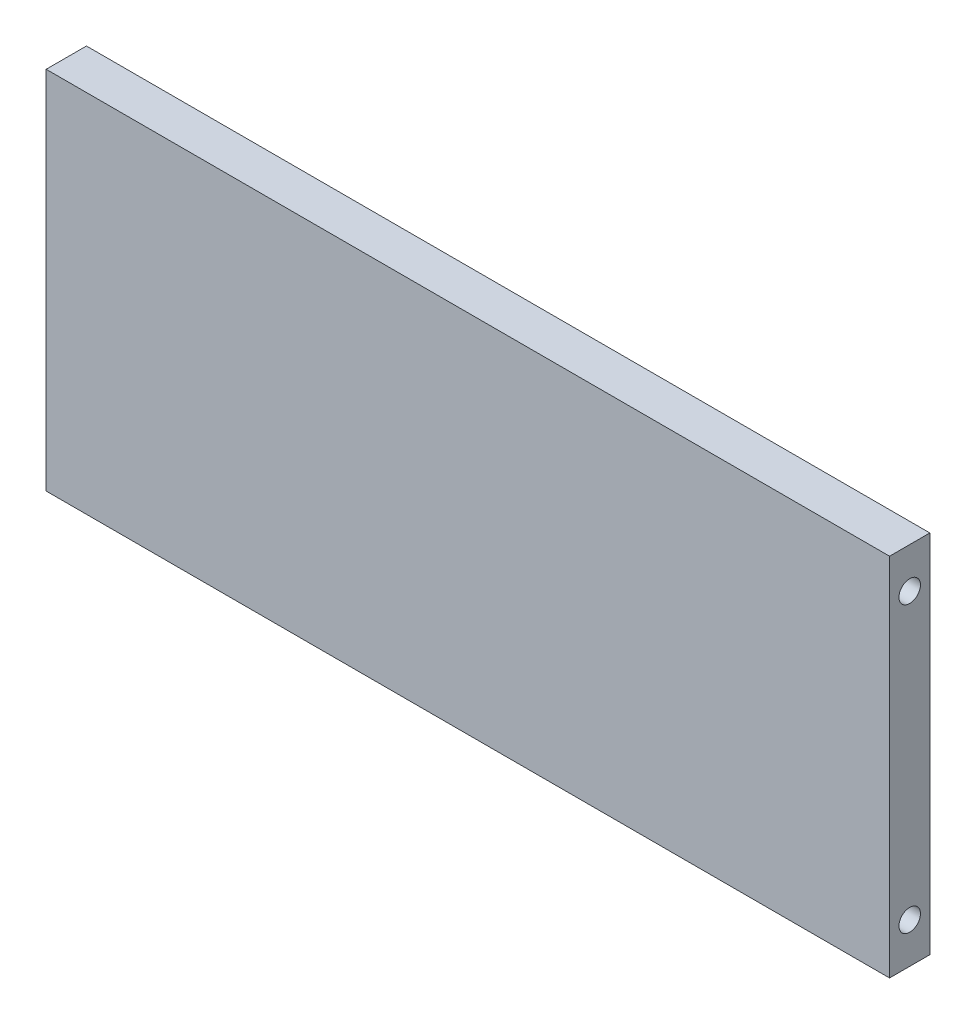
ISO-10303-21;
HEADER;
FILE_DESCRIPTION(('STEP AP214'),'2;1');
FILE_NAME('part.step','',(''),(''),'','','');
FILE_SCHEMA(('AUTOMOTIVE_DESIGN { 1 0 10303 214 1 1 1 1 }'));
ENDSEC;
DATA;
#1=APPLICATION_CONTEXT('core data for automotive mechanical design processes');
#2=APPLICATION_PROTOCOL_DEFINITION('international standard','automotive_design',2000,#1);
#3=PRODUCT_CONTEXT('',#1,'mechanical');
#4=PRODUCT('Part','Part','',(#3));
#5=PRODUCT_RELATED_PRODUCT_CATEGORY('part','',(#4));
#6=PRODUCT_DEFINITION_FORMATION('','',#4);
#7=PRODUCT_DEFINITION_CONTEXT('part definition',#1,'design');
#8=PRODUCT_DEFINITION('design','',#6,#7);
#9=PRODUCT_DEFINITION_SHAPE('','',#8);
#10=(LENGTH_UNIT() NAMED_UNIT(*) SI_UNIT(.MILLI.,.METRE.));
#11=(NAMED_UNIT(*) PLANE_ANGLE_UNIT() SI_UNIT($,.RADIAN.));
#12=(NAMED_UNIT(*) SI_UNIT($,.STERADIAN.) SOLID_ANGLE_UNIT());
#13=UNCERTAINTY_MEASURE_WITH_UNIT(LENGTH_MEASURE(1.E-05),#10,'distance_accuracy_value','');
#14=(GEOMETRIC_REPRESENTATION_CONTEXT(3) GLOBAL_UNCERTAINTY_ASSIGNED_CONTEXT((#13)) GLOBAL_UNIT_ASSIGNED_CONTEXT((#10,
#11,#12)) REPRESENTATION_CONTEXT('',''));
#15=CARTESIAN_POINT('',(0.,0.,0.));
#16=DIRECTION('',(0.,0.,1.));
#17=DIRECTION('',(1.,0.,0.));
#18=AXIS2_PLACEMENT_3D('',#15,#16,#17);
#19=CARTESIAN_POINT('',(157.,-68.,15.));
#20=DIRECTION('',(-1.,0.,0.));
#21=DIRECTION('',(0.,0.,1.));
#22=AXIS2_PLACEMENT_3D('',#19,#20,#21);
#23=PLANE('',#22);
#24=CARTESIAN_POINT('',(157.,-53.,7.50000000000001));
#25=DIRECTION('',(-1.,0.,0.));
#26=DIRECTION('',(0.,0.,1.));
#27=AXIS2_PLACEMENT_3D('',#24,#25,#26);
#28=CIRCLE('',#27,4.);
#29=CARTESIAN_POINT('',(157.,-53.,11.5));
#30=VERTEX_POINT('',#29);
#31=EDGE_CURVE('E158',#30,#30,#28,.T.);
#32=ORIENTED_EDGE('',*,*,#31,.T.);
#33=EDGE_LOOP('',(#32));
#34=FACE_BOUND('',#33,.T.);
#35=CARTESIAN_POINT('',(157.,53.,7.50000000000001));
#36=DIRECTION('',(-1.,0.,0.));
#37=DIRECTION('',(0.,0.,1.));
#38=AXIS2_PLACEMENT_3D('',#35,#36,#37);
#39=CIRCLE('',#38,4.);
#40=CARTESIAN_POINT('',(157.,53.,11.5));
#41=VERTEX_POINT('',#40);
#42=EDGE_CURVE('E150',#41,#41,#39,.T.);
#43=ORIENTED_EDGE('',*,*,#42,.T.);
#44=EDGE_LOOP('',(#43));
#45=FACE_BOUND('',#44,.T.);
#46=DIRECTION('',(0.,1.,0.));
#47=VECTOR('',#46,1.);
#48=CARTESIAN_POINT('',(157.,-68.,0.));
#49=LINE('',#48,#47);
#50=CARTESIAN_POINT('',(157.,-68.,0.));
#51=VERTEX_POINT('',#50);
#52=CARTESIAN_POINT('',(157.,68.,0.));
#53=VERTEX_POINT('',#52);
#54=EDGE_CURVE('E111',#51,#53,#49,.T.);
#55=ORIENTED_EDGE('',*,*,#54,.T.);
#56=DIRECTION('',(0.,0.,-1.));
#57=VECTOR('',#56,1.);
#58=CARTESIAN_POINT('',(157.,68.,15.));
#59=LINE('',#58,#57);
#60=CARTESIAN_POINT('',(157.,68.,15.));
#61=VERTEX_POINT('',#60);
#62=EDGE_CURVE('E11',#61,#53,#59,.T.);
#63=ORIENTED_EDGE('',*,*,#62,.F.);
#64=DIRECTION('',(0.,1.,0.));
#65=VECTOR('',#64,1.);
#66=CARTESIAN_POINT('',(157.,-68.,15.));
#67=LINE('',#66,#65);
#68=CARTESIAN_POINT('',(157.,-68.,15.));
#69=VERTEX_POINT('',#68);
#70=EDGE_CURVE('E94',#69,#61,#67,.T.);
#71=ORIENTED_EDGE('',*,*,#70,.F.);
#72=DIRECTION('',(0.,0.,-1.));
#73=VECTOR('',#72,1.);
#74=CARTESIAN_POINT('',(157.,-68.,15.));
#75=LINE('',#74,#73);
#76=EDGE_CURVE('E107',#69,#51,#75,.T.);
#77=ORIENTED_EDGE('',*,*,#76,.T.);
#78=EDGE_LOOP('',(#55,#63,#71,#77));
#79=FACE_BOUND('',#78,.T.);
#80=ADVANCED_FACE('F42',(#34,#45,#79),#23,.F.);
#81=CARTESIAN_POINT('',(-157.,68.,15.));
#82=DIRECTION('',(0.,-1.,0.));
#83=DIRECTION('',(0.,0.,-1.));
#84=AXIS2_PLACEMENT_3D('',#81,#82,#83);
#85=PLANE('',#84);
#86=DIRECTION('',(-1.,0.,0.));
#87=VECTOR('',#86,1.);
#88=CARTESIAN_POINT('',(-157.,68.,0.));
#89=LINE('',#88,#87);
#90=CARTESIAN_POINT('',(-157.,68.,0.));
#91=VERTEX_POINT('',#90);
#92=EDGE_CURVE('E99',#53,#91,#89,.T.);
#93=ORIENTED_EDGE('',*,*,#92,.T.);
#94=DIRECTION('',(0.,0.,-1.));
#95=VECTOR('',#94,1.);
#96=CARTESIAN_POINT('',(-157.,68.,15.));
#97=LINE('',#96,#95);
#98=CARTESIAN_POINT('',(-157.,68.,15.));
#99=VERTEX_POINT('',#98);
#100=EDGE_CURVE('E51',#99,#91,#97,.T.);
#101=ORIENTED_EDGE('',*,*,#100,.F.);
#102=DIRECTION('',(-1.,0.,0.));
#103=VECTOR('',#102,1.);
#104=CARTESIAN_POINT('',(-157.,68.,15.));
#105=LINE('',#104,#103);
#106=EDGE_CURVE('E89',#61,#99,#105,.T.);
#107=ORIENTED_EDGE('',*,*,#106,.F.);
#108=ORIENTED_EDGE('',*,*,#62,.T.);
#109=EDGE_LOOP('',(#93,#101,#107,#108));
#110=FACE_BOUND('',#109,.T.);
#111=ADVANCED_FACE('F98',(#110),#85,.F.);
#112=CARTESIAN_POINT('',(-157.,-68.,15.));
#113=DIRECTION('',(1.,0.,0.));
#114=DIRECTION('',(0.,0.,-1.));
#115=AXIS2_PLACEMENT_3D('',#112,#113,#114);
#116=PLANE('',#115);
#117=CARTESIAN_POINT('',(-157.,-53.,7.50000000000001));
#118=DIRECTION('',(-1.,0.,0.));
#119=DIRECTION('',(0.,0.,1.));
#120=AXIS2_PLACEMENT_3D('',#117,#118,#119);
#121=CIRCLE('',#120,4.);
#122=CARTESIAN_POINT('',(-157.,-53.,11.5));
#123=VERTEX_POINT('',#122);
#124=EDGE_CURVE('E142',#123,#123,#121,.T.);
#125=ORIENTED_EDGE('',*,*,#124,.F.);
#126=EDGE_LOOP('',(#125));
#127=FACE_BOUND('',#126,.T.);
#128=CARTESIAN_POINT('',(-157.,53.,7.50000000000001));
#129=DIRECTION('',(-1.,0.,0.));
#130=DIRECTION('',(0.,0.,1.));
#131=AXIS2_PLACEMENT_3D('',#128,#129,#130);
#132=CIRCLE('',#131,4.);
#133=CARTESIAN_POINT('',(-157.,53.,11.5));
#134=VERTEX_POINT('',#133);
#135=EDGE_CURVE('E134',#134,#134,#132,.T.);
#136=ORIENTED_EDGE('',*,*,#135,.F.);
#137=EDGE_LOOP('',(#136));
#138=FACE_BOUND('',#137,.T.);
#139=DIRECTION('',(0.,-1.,0.));
#140=VECTOR('',#139,1.);
#141=CARTESIAN_POINT('',(-157.,-68.,0.));
#142=LINE('',#141,#140);
#143=CARTESIAN_POINT('',(-157.,-68.,0.));
#144=VERTEX_POINT('',#143);
#145=EDGE_CURVE('E76',#91,#144,#142,.T.);
#146=ORIENTED_EDGE('',*,*,#145,.T.);
#147=DIRECTION('',(0.,0.,-1.));
#148=VECTOR('',#147,1.);
#149=CARTESIAN_POINT('',(-157.,-68.,15.));
#150=LINE('',#149,#148);
#151=CARTESIAN_POINT('',(-157.,-68.,15.));
#152=VERTEX_POINT('',#151);
#153=EDGE_CURVE('E101',#152,#144,#150,.T.);
#154=ORIENTED_EDGE('',*,*,#153,.F.);
#155=DIRECTION('',(0.,-1.,0.));
#156=VECTOR('',#155,1.);
#157=CARTESIAN_POINT('',(-157.,-68.,15.));
#158=LINE('',#157,#156);
#159=EDGE_CURVE('E92',#99,#152,#158,.T.);
#160=ORIENTED_EDGE('',*,*,#159,.F.);
#161=ORIENTED_EDGE('',*,*,#100,.T.);
#162=EDGE_LOOP('',(#146,#154,#160,#161));
#163=FACE_BOUND('',#162,.T.);
#164=ADVANCED_FACE('F102',(#127,#138,#163),#116,.F.);
#165=CARTESIAN_POINT('',(-157.,-68.,15.));
#166=DIRECTION('',(0.,1.,0.));
#167=DIRECTION('',(0.,0.,1.));
#168=AXIS2_PLACEMENT_3D('',#165,#166,#167);
#169=PLANE('',#168);
#170=CARTESIAN_POINT('',(142.,-68.,7.50000000000001));
#171=DIRECTION('',(0.,-1.,0.));
#172=DIRECTION('',(0.,0.,-1.));
#173=AXIS2_PLACEMENT_3D('',#170,#171,#172);
#174=CIRCLE('',#173,3.99999999999999);
#175=CARTESIAN_POINT('',(142.,-68.,3.50000000000001));
#176=VERTEX_POINT('',#175);
#177=EDGE_CURVE('E185',#176,#176,#174,.T.);
#178=ORIENTED_EDGE('',*,*,#177,.F.);
#179=EDGE_LOOP('',(#178));
#180=FACE_BOUND('',#179,.T.);
#181=CARTESIAN_POINT('',(0.,-68.,7.50000000000001));
#182=DIRECTION('',(0.,-1.,0.));
#183=DIRECTION('',(0.,0.,-1.));
#184=AXIS2_PLACEMENT_3D('',#181,#182,#183);
#185=CIRCLE('',#184,3.99999999999999);
#186=CARTESIAN_POINT('',(0.,-68.,3.50000000000001));
#187=VERTEX_POINT('',#186);
#188=EDGE_CURVE('E177',#187,#187,#185,.T.);
#189=ORIENTED_EDGE('',*,*,#188,.F.);
#190=EDGE_LOOP('',(#189));
#191=FACE_BOUND('',#190,.T.);
#192=CARTESIAN_POINT('',(-142.,-68.,7.50000000000001));
#193=DIRECTION('',(0.,-1.,0.));
#194=DIRECTION('',(0.,0.,-1.));
#195=AXIS2_PLACEMENT_3D('',#192,#193,#194);
#196=CIRCLE('',#195,3.99999999999999);
#197=CARTESIAN_POINT('',(-142.,-68.,3.50000000000001));
#198=VERTEX_POINT('',#197);
#199=EDGE_CURVE('E166',#198,#198,#196,.T.);
#200=ORIENTED_EDGE('',*,*,#199,.F.);
#201=EDGE_LOOP('',(#200));
#202=FACE_BOUND('',#201,.T.);
#203=DIRECTION('',(1.,0.,0.));
#204=VECTOR('',#203,1.);
#205=CARTESIAN_POINT('',(-157.,-68.,0.));
#206=LINE('',#205,#204);
#207=EDGE_CURVE('E82',#144,#51,#206,.T.);
#208=ORIENTED_EDGE('',*,*,#207,.T.);
#209=ORIENTED_EDGE('',*,*,#76,.F.);
#210=DIRECTION('',(1.,0.,0.));
#211=VECTOR('',#210,1.);
#212=CARTESIAN_POINT('',(-157.,-68.,15.));
#213=LINE('',#212,#211);
#214=EDGE_CURVE('E59',#152,#69,#213,.T.);
#215=ORIENTED_EDGE('',*,*,#214,.F.);
#216=ORIENTED_EDGE('',*,*,#153,.T.);
#217=EDGE_LOOP('',(#208,#209,#215,#216));
#218=FACE_BOUND('',#217,.T.);
#219=ADVANCED_FACE('F126',(#180,#191,#202,#218),#169,.F.);
#220=CARTESIAN_POINT('',(0.,0.,15.));
#221=DIRECTION('',(0.,0.,-1.));
#222=DIRECTION('',(-1.,0.,0.));
#223=AXIS2_PLACEMENT_3D('',#220,#221,#222);
#224=PLANE('',#223);
#225=ORIENTED_EDGE('',*,*,#70,.T.);
#226=ORIENTED_EDGE('',*,*,#106,.T.);
#227=ORIENTED_EDGE('',*,*,#159,.T.);
#228=ORIENTED_EDGE('',*,*,#214,.T.);
#229=EDGE_LOOP('',(#225,#226,#227,#228));
#230=FACE_BOUND('',#229,.T.);
#231=ADVANCED_FACE('F90',(#230),#224,.F.);
#232=CARTESIAN_POINT('',(0.,0.,0.));
#233=DIRECTION('',(0.,0.,-1.));
#234=DIRECTION('',(-1.,0.,0.));
#235=AXIS2_PLACEMENT_3D('',#232,#233,#234);
#236=PLANE('',#235);
#237=ORIENTED_EDGE('',*,*,#54,.F.);
#238=ORIENTED_EDGE('',*,*,#207,.F.);
#239=ORIENTED_EDGE('',*,*,#145,.F.);
#240=ORIENTED_EDGE('',*,*,#92,.F.);
#241=EDGE_LOOP('',(#237,#238,#239,#240));
#242=FACE_BOUND('',#241,.T.);
#243=ADVANCED_FACE('F129',(#242),#236,.T.);
#244=CARTESIAN_POINT('',(-147.,53.,7.50000000000001));
#245=DIRECTION('',(-1.,0.,0.));
#246=DIRECTION('',(0.,0.,1.));
#247=AXIS2_PLACEMENT_3D('',#244,#245,#246);
#248=CYLINDRICAL_SURFACE('',#247,4.);
#249=CARTESIAN_POINT('',(-147.,53.,7.50000000000001));
#250=DIRECTION('',(-1.,0.,0.));
#251=DIRECTION('',(0.,0.,1.));
#252=AXIS2_PLACEMENT_3D('',#249,#250,#251);
#253=CIRCLE('',#252,4.);
#254=CARTESIAN_POINT('',(-147.,53.,11.5));
#255=VERTEX_POINT('',#254);
#256=EDGE_CURVE('E115',#255,#255,#253,.T.);
#257=ORIENTED_EDGE('',*,*,#256,.F.);
#258=EDGE_LOOP('',(#257));
#259=FACE_BOUND('',#258,.T.);
#260=ORIENTED_EDGE('',*,*,#135,.T.);
#261=EDGE_LOOP('',(#260));
#262=FACE_BOUND('',#261,.T.);
#263=ADVANCED_FACE('F249',(#259,#262),#248,.F.);
#264=CARTESIAN_POINT('',(-147.,53.,7.50000000000001));
#265=DIRECTION('',(-1.,0.,0.));
#266=DIRECTION('',(0.,0.,1.));
#267=AXIS2_PLACEMENT_3D('',#264,#265,#266);
#268=PLANE('',#267);
#269=ORIENTED_EDGE('',*,*,#256,.T.);
#270=EDGE_LOOP('',(#269));
#271=FACE_BOUND('',#270,.T.);
#272=ADVANCED_FACE('F245',(#271),#268,.T.);
#273=CARTESIAN_POINT('',(-147.,-53.,7.50000000000001));
#274=DIRECTION('',(-1.,0.,0.));
#275=DIRECTION('',(0.,0.,1.));
#276=AXIS2_PLACEMENT_3D('',#273,#274,#275);
#277=CYLINDRICAL_SURFACE('',#276,4.);
#278=CARTESIAN_POINT('',(-147.,-53.,7.50000000000001));
#279=DIRECTION('',(-1.,0.,0.));
#280=DIRECTION('',(0.,0.,1.));
#281=AXIS2_PLACEMENT_3D('',#278,#279,#280);
#282=CIRCLE('',#281,4.);
#283=CARTESIAN_POINT('',(-147.,-53.,11.5));
#284=VERTEX_POINT('',#283);
#285=EDGE_CURVE('E138',#284,#284,#282,.T.);
#286=ORIENTED_EDGE('',*,*,#285,.F.);
#287=EDGE_LOOP('',(#286));
#288=FACE_BOUND('',#287,.T.);
#289=ORIENTED_EDGE('',*,*,#124,.T.);
#290=EDGE_LOOP('',(#289));
#291=FACE_BOUND('',#290,.T.);
#292=ADVANCED_FACE('F238',(#288,#291),#277,.F.);
#293=CARTESIAN_POINT('',(-147.,-53.,7.50000000000001));
#294=DIRECTION('',(-1.,0.,0.));
#295=DIRECTION('',(0.,0.,1.));
#296=AXIS2_PLACEMENT_3D('',#293,#294,#295);
#297=PLANE('',#296);
#298=ORIENTED_EDGE('',*,*,#285,.T.);
#299=EDGE_LOOP('',(#298));
#300=FACE_BOUND('',#299,.T.);
#301=ADVANCED_FACE('F229',(#300),#297,.T.);
#302=CARTESIAN_POINT('',(147.,53.,7.50000000000001));
#303=DIRECTION('',(1.,0.,0.));
#304=DIRECTION('',(0.,0.,-1.));
#305=AXIS2_PLACEMENT_3D('',#302,#303,#304);
#306=CYLINDRICAL_SURFACE('',#305,4.);
#307=CARTESIAN_POINT('',(147.,53.,7.50000000000001));
#308=DIRECTION('',(-1.,0.,0.));
#309=DIRECTION('',(0.,0.,1.));
#310=AXIS2_PLACEMENT_3D('',#307,#308,#309);
#311=CIRCLE('',#310,4.);
#312=CARTESIAN_POINT('',(147.,53.,11.5));
#313=VERTEX_POINT('',#312);
#314=EDGE_CURVE('E146',#313,#313,#311,.T.);
#315=ORIENTED_EDGE('',*,*,#314,.T.);
#316=EDGE_LOOP('',(#315));
#317=FACE_BOUND('',#316,.T.);
#318=ORIENTED_EDGE('',*,*,#42,.F.);
#319=EDGE_LOOP('',(#318));
#320=FACE_BOUND('',#319,.T.);
#321=ADVANCED_FACE('F226',(#317,#320),#306,.F.);
#322=CARTESIAN_POINT('',(147.,53.,7.50000000000001));
#323=DIRECTION('',(1.,0.,0.));
#324=DIRECTION('',(0.,0.,1.));
#325=AXIS2_PLACEMENT_3D('',#322,#323,#324);
#326=PLANE('',#325);
#327=ORIENTED_EDGE('',*,*,#314,.F.);
#328=EDGE_LOOP('',(#327));
#329=FACE_BOUND('',#328,.T.);
#330=ADVANCED_FACE('F228',(#329),#326,.T.);
#331=CARTESIAN_POINT('',(147.,-53.,7.50000000000001));
#332=DIRECTION('',(1.,0.,0.));
#333=DIRECTION('',(0.,0.,-1.));
#334=AXIS2_PLACEMENT_3D('',#331,#332,#333);
#335=CYLINDRICAL_SURFACE('',#334,4.);
#336=CARTESIAN_POINT('',(147.,-53.,7.50000000000001));
#337=DIRECTION('',(-1.,0.,0.));
#338=DIRECTION('',(0.,0.,1.));
#339=AXIS2_PLACEMENT_3D('',#336,#337,#338);
#340=CIRCLE('',#339,4.);
#341=CARTESIAN_POINT('',(147.,-53.,11.5));
#342=VERTEX_POINT('',#341);
#343=EDGE_CURVE('E154',#342,#342,#340,.T.);
#344=ORIENTED_EDGE('',*,*,#343,.T.);
#345=EDGE_LOOP('',(#344));
#346=FACE_BOUND('',#345,.T.);
#347=ORIENTED_EDGE('',*,*,#31,.F.);
#348=EDGE_LOOP('',(#347));
#349=FACE_BOUND('',#348,.T.);
#350=ADVANCED_FACE('F213',(#346,#349),#335,.F.);
#351=CARTESIAN_POINT('',(147.,-53.,7.50000000000001));
#352=DIRECTION('',(1.,0.,0.));
#353=DIRECTION('',(0.,0.,1.));
#354=AXIS2_PLACEMENT_3D('',#351,#352,#353);
#355=PLANE('',#354);
#356=ORIENTED_EDGE('',*,*,#343,.F.);
#357=EDGE_LOOP('',(#356));
#358=FACE_BOUND('',#357,.T.);
#359=ADVANCED_FACE('F203',(#358),#355,.T.);
#360=CARTESIAN_POINT('',(-142.,-58.,7.50000000000001));
#361=DIRECTION('',(0.,-1.,0.));
#362=DIRECTION('',(0.,0.,-1.));
#363=AXIS2_PLACEMENT_3D('',#360,#361,#362);
#364=CYLINDRICAL_SURFACE('',#363,3.99999999999999);
#365=CARTESIAN_POINT('',(-142.,-58.,7.50000000000001));
#366=DIRECTION('',(0.,-1.,0.));
#367=DIRECTION('',(0.,0.,-1.));
#368=AXIS2_PLACEMENT_3D('',#365,#366,#367);
#369=CIRCLE('',#368,3.99999999999999);
#370=CARTESIAN_POINT('',(-142.,-58.,3.50000000000001));
#371=VERTEX_POINT('',#370);
#372=EDGE_CURVE('E162',#371,#371,#369,.T.);
#373=ORIENTED_EDGE('',*,*,#372,.F.);
#374=EDGE_LOOP('',(#373));
#375=FACE_BOUND('',#374,.T.);
#376=ORIENTED_EDGE('',*,*,#199,.T.);
#377=EDGE_LOOP('',(#376));
#378=FACE_BOUND('',#377,.T.);
#379=ADVANCED_FACE('F200',(#375,#378),#364,.F.);
#380=CARTESIAN_POINT('',(-142.,-58.,7.50000000000001));
#381=DIRECTION('',(0.,-1.,0.));
#382=DIRECTION('',(0.,0.,-1.));
#383=AXIS2_PLACEMENT_3D('',#380,#381,#382);
#384=PLANE('',#383);
#385=ORIENTED_EDGE('',*,*,#372,.T.);
#386=EDGE_LOOP('',(#385));
#387=FACE_BOUND('',#386,.T.);
#388=ADVANCED_FACE('F202',(#387),#384,.T.);
#389=CARTESIAN_POINT('',(0.,-58.,7.50000000000001));
#390=DIRECTION('',(0.,-1.,0.));
#391=DIRECTION('',(0.,0.,-1.));
#392=AXIS2_PLACEMENT_3D('',#389,#390,#391);
#393=CYLINDRICAL_SURFACE('',#392,3.99999999999999);
#394=CARTESIAN_POINT('',(0.,-58.,7.50000000000001));
#395=DIRECTION('',(0.,-1.,0.));
#396=DIRECTION('',(0.,0.,-1.));
#397=AXIS2_PLACEMENT_3D('',#394,#395,#396);
#398=CIRCLE('',#397,3.99999999999999);
#399=CARTESIAN_POINT('',(0.,-58.,3.50000000000001));
#400=VERTEX_POINT('',#399);
#401=EDGE_CURVE('E170',#400,#400,#398,.T.);
#402=ORIENTED_EDGE('',*,*,#401,.F.);
#403=EDGE_LOOP('',(#402));
#404=FACE_BOUND('',#403,.T.);
#405=ORIENTED_EDGE('',*,*,#188,.T.);
#406=EDGE_LOOP('',(#405));
#407=FACE_BOUND('',#406,.T.);
#408=ADVANCED_FACE('F210',(#404,#407),#393,.F.);
#409=CARTESIAN_POINT('',(0.,-58.,7.50000000000001));
#410=DIRECTION('',(0.,-1.,0.));
#411=DIRECTION('',(0.,0.,-1.));
#412=AXIS2_PLACEMENT_3D('',#409,#410,#411);
#413=PLANE('',#412);
#414=ORIENTED_EDGE('',*,*,#401,.T.);
#415=EDGE_LOOP('',(#414));
#416=FACE_BOUND('',#415,.T.);
#417=ADVANCED_FACE('F348',(#416),#413,.T.);
#418=CARTESIAN_POINT('',(142.,-58.,7.50000000000001));
#419=DIRECTION('',(0.,-1.,0.));
#420=DIRECTION('',(0.,0.,-1.));
#421=AXIS2_PLACEMENT_3D('',#418,#419,#420);
#422=CYLINDRICAL_SURFACE('',#421,3.99999999999999);
#423=CARTESIAN_POINT('',(142.,-58.,7.50000000000001));
#424=DIRECTION('',(0.,-1.,0.));
#425=DIRECTION('',(0.,0.,-1.));
#426=AXIS2_PLACEMENT_3D('',#423,#424,#425);
#427=CIRCLE('',#426,3.99999999999999);
#428=CARTESIAN_POINT('',(142.,-58.,3.50000000000001));
#429=VERTEX_POINT('',#428);
#430=EDGE_CURVE('E181',#429,#429,#427,.T.);
#431=ORIENTED_EDGE('',*,*,#430,.F.);
#432=EDGE_LOOP('',(#431));
#433=FACE_BOUND('',#432,.T.);
#434=ORIENTED_EDGE('',*,*,#177,.T.);
#435=EDGE_LOOP('',(#434));
#436=FACE_BOUND('',#435,.T.);
#437=ADVANCED_FACE('F191',(#433,#436),#422,.F.);
#438=CARTESIAN_POINT('',(142.,-58.,7.50000000000001));
#439=DIRECTION('',(0.,-1.,0.));
#440=DIRECTION('',(0.,0.,-1.));
#441=AXIS2_PLACEMENT_3D('',#438,#439,#440);
#442=PLANE('',#441);
#443=ORIENTED_EDGE('',*,*,#430,.T.);
#444=EDGE_LOOP('',(#443));
#445=FACE_BOUND('',#444,.T.);
#446=ADVANCED_FACE('F367',(#445),#442,.T.);
#447=CLOSED_SHELL('',(#80,#111,#164,#219,#231,#243,#263,#272,#292,#301,#321,#330,#350,#359,#379,
#388,#408,#417,#437,#446));
#448=MANIFOLD_SOLID_BREP('B2',#447);
#449=ADVANCED_BREP_SHAPE_REPRESENTATION('',(#18,#448),#14);
#450=SHAPE_DEFINITION_REPRESENTATION(#9,#449);
ENDSEC;
END-ISO-10303-21;
